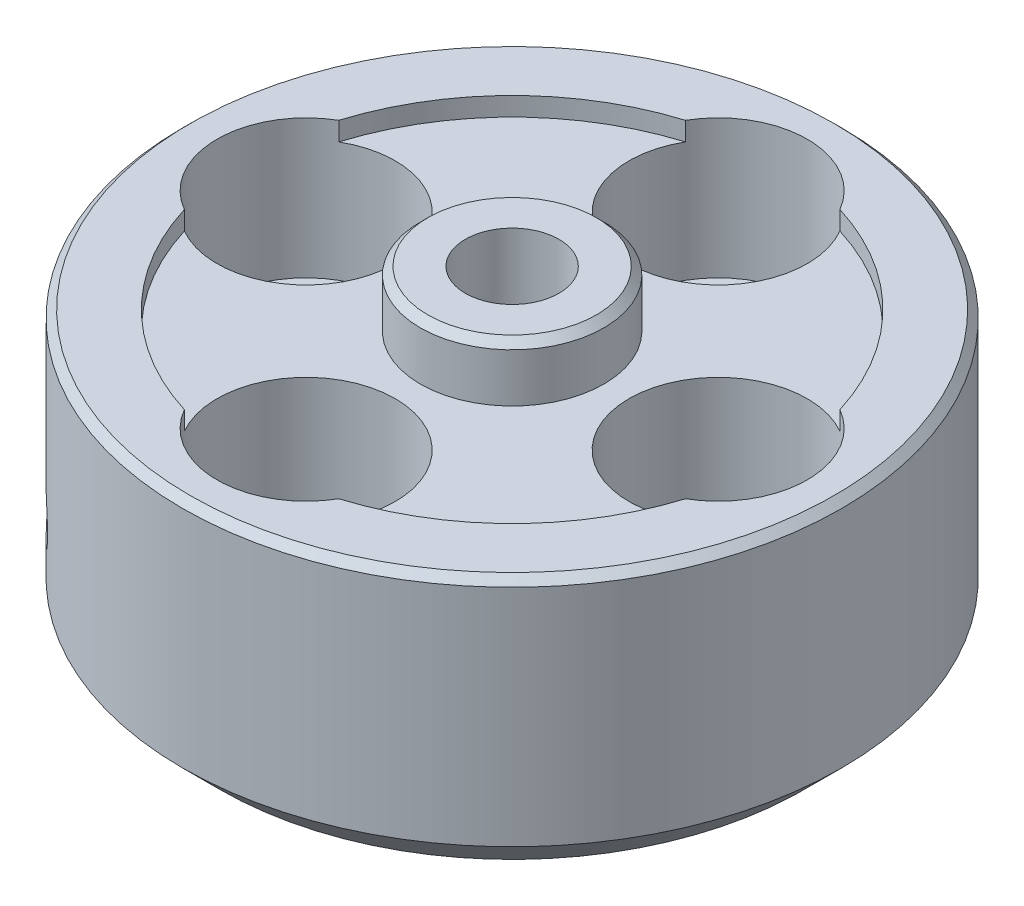
ISO-10303-21;
HEADER;
FILE_DESCRIPTION(('STEP AP214'),'2;1');
FILE_NAME('part.step','',(''),(''),'','','');
FILE_SCHEMA(('AUTOMOTIVE_DESIGN { 1 0 10303 214 1 1 1 1 }'));
ENDSEC;
DATA;
#1=APPLICATION_CONTEXT('core data for automotive mechanical design processes');
#2=APPLICATION_PROTOCOL_DEFINITION('international standard','automotive_design',2000,#1);
#3=PRODUCT_CONTEXT('',#1,'mechanical');
#4=PRODUCT('Part','Part','',(#3));
#5=PRODUCT_RELATED_PRODUCT_CATEGORY('part','',(#4));
#6=PRODUCT_DEFINITION_FORMATION('','',#4);
#7=PRODUCT_DEFINITION_CONTEXT('part definition',#1,'design');
#8=PRODUCT_DEFINITION('design','',#6,#7);
#9=PRODUCT_DEFINITION_SHAPE('','',#8);
#10=(LENGTH_UNIT() NAMED_UNIT(*) SI_UNIT(.MILLI.,.METRE.));
#11=(NAMED_UNIT(*) PLANE_ANGLE_UNIT() SI_UNIT($,.RADIAN.));
#12=(NAMED_UNIT(*) SI_UNIT($,.STERADIAN.) SOLID_ANGLE_UNIT());
#13=UNCERTAINTY_MEASURE_WITH_UNIT(LENGTH_MEASURE(1.E-05),#10,'distance_accuracy_value','');
#14=(GEOMETRIC_REPRESENTATION_CONTEXT(3) GLOBAL_UNCERTAINTY_ASSIGNED_CONTEXT((#13)) GLOBAL_UNIT_ASSIGNED_CONTEXT((#10,
#11,#12)) REPRESENTATION_CONTEXT('',''));
#15=CARTESIAN_POINT('',(0.,0.,0.));
#16=DIRECTION('',(0.,0.,1.));
#17=DIRECTION('',(1.,0.,0.));
#18=AXIS2_PLACEMENT_3D('',#15,#16,#17);
#19=CARTESIAN_POINT('',(0.,8.509,0.));
#20=DIRECTION('',(0.,1.,0.));
#21=DIRECTION('',(0.,0.,1.));
#22=AXIS2_PLACEMENT_3D('',#19,#20,#21);
#23=CYLINDRICAL_SURFACE('',#22,8.89);
#24=CARTESIAN_POINT('',(0.,8.509,0.));
#25=DIRECTION('',(0.,1.,0.));
#26=DIRECTION('',(0.,0.,1.));
#27=AXIS2_PLACEMENT_3D('',#24,#25,#26);
#28=CIRCLE('',#27,8.89);
#29=CARTESIAN_POINT('',(8.49579200000001,8.509,-2.6179416136988));
#30=VERTEX_POINT('',#29);
#31=CARTESIAN_POINT('',(2.61794161369883,8.509,-8.495792));
#32=VERTEX_POINT('',#31);
#33=EDGE_CURVE('E158',#30,#32,#28,.T.);
#34=ORIENTED_EDGE('',*,*,#33,.F.);
#35=DIRECTION('',(0.,1.,0.));
#36=VECTOR('',#35,1.);
#37=CARTESIAN_POINT('',(8.495792,6.7945,-2.6179416136988));
#38=LINE('',#37,#36);
#39=CARTESIAN_POINT('',(8.49579200000001,9.144,-2.6179416136988));
#40=VERTEX_POINT('',#39);
#41=EDGE_CURVE('E76',#30,#40,#38,.T.);
#42=ORIENTED_EDGE('',*,*,#41,.T.);
#43=CARTESIAN_POINT('',(0.,9.144,0.));
#44=DIRECTION('',(0.,1.,0.));
#45=DIRECTION('',(0.,0.,1.));
#46=AXIS2_PLACEMENT_3D('',#43,#44,#45);
#47=CIRCLE('',#46,8.89);
#48=CARTESIAN_POINT('',(2.61794161369883,9.144,-8.495792));
#49=VERTEX_POINT('',#48);
#50=EDGE_CURVE('E160',#40,#49,#47,.T.);
#51=ORIENTED_EDGE('',*,*,#50,.T.);
#52=DIRECTION('',(0.,1.,0.));
#53=VECTOR('',#52,1.);
#54=CARTESIAN_POINT('',(2.61794161369883,6.7945,-8.49579199999999));
#55=LINE('',#54,#53);
#56=EDGE_CURVE('E224',#49,#32,#55,.F.);
#57=ORIENTED_EDGE('',*,*,#56,.T.);
#58=EDGE_LOOP('',(#34,#42,#51,#57));
#59=FACE_BOUND('',#58,.T.);
#60=ADVANCED_FACE('F53',(#59),#23,.F.);
#61=CARTESIAN_POINT('',(2.61794161369883,9.144,8.495792));
#62=VERTEX_POINT('',#61);
#63=CARTESIAN_POINT('',(8.49579199999999,9.144,2.61794161369885));
#64=VERTEX_POINT('',#63);
#65=EDGE_CURVE('E166',#62,#64,#47,.T.);
#66=ORIENTED_EDGE('',*,*,#65,.T.);
#67=DIRECTION('',(0.,1.,0.));
#68=VECTOR('',#67,1.);
#69=CARTESIAN_POINT('',(8.49579199999999,6.7945,2.61794161369886));
#70=LINE('',#69,#68);
#71=CARTESIAN_POINT('',(8.49579199999999,8.509,2.61794161369886));
#72=VERTEX_POINT('',#71);
#73=EDGE_CURVE('E209',#64,#72,#70,.F.);
#74=ORIENTED_EDGE('',*,*,#73,.T.);
#75=CARTESIAN_POINT('',(2.61794161369883,8.509,8.495792));
#76=VERTEX_POINT('',#75);
#77=EDGE_CURVE('E163',#76,#72,#28,.T.);
#78=ORIENTED_EDGE('',*,*,#77,.F.);
#79=DIRECTION('',(0.,1.,0.));
#80=VECTOR('',#79,1.);
#81=CARTESIAN_POINT('',(2.61794161369883,6.7945,8.49579199999999));
#82=LINE('',#81,#80);
#83=EDGE_CURVE('E84',#76,#62,#82,.T.);
#84=ORIENTED_EDGE('',*,*,#83,.T.);
#85=EDGE_LOOP('',(#66,#74,#78,#84));
#86=FACE_BOUND('',#85,.T.);
#87=ADVANCED_FACE('F207',(#86),#23,.F.);
#88=CARTESIAN_POINT('',(-8.49579200000002,9.144,2.61794161369874));
#89=VERTEX_POINT('',#88);
#90=CARTESIAN_POINT('',(-2.61794161369883,9.144,8.495792));
#91=VERTEX_POINT('',#90);
#92=EDGE_CURVE('E149',#89,#91,#47,.T.);
#93=ORIENTED_EDGE('',*,*,#92,.T.);
#94=DIRECTION('',(0.,1.,0.));
#95=VECTOR('',#94,1.);
#96=CARTESIAN_POINT('',(-2.61794161369883,6.7945,8.49579199999999));
#97=LINE('',#96,#95);
#98=CARTESIAN_POINT('',(-2.61794161369883,8.509,8.495792));
#99=VERTEX_POINT('',#98);
#100=EDGE_CURVE('E216',#91,#99,#97,.F.);
#101=ORIENTED_EDGE('',*,*,#100,.T.);
#102=CARTESIAN_POINT('',(-8.49579200000002,8.509,2.61794161369874));
#103=VERTEX_POINT('',#102);
#104=EDGE_CURVE('E189',#103,#99,#28,.T.);
#105=ORIENTED_EDGE('',*,*,#104,.F.);
#106=DIRECTION('',(0.,1.,0.));
#107=VECTOR('',#106,1.);
#108=CARTESIAN_POINT('',(-8.49579200000002,6.7945,2.61794161369874));
#109=LINE('',#108,#107);
#110=EDGE_CURVE('E137',#103,#89,#109,.T.);
#111=ORIENTED_EDGE('',*,*,#110,.T.);
#112=EDGE_LOOP('',(#93,#101,#105,#111));
#113=FACE_BOUND('',#112,.T.);
#114=ADVANCED_FACE('F246',(#113),#23,.F.);
#115=CARTESIAN_POINT('',(0.,9.144,0.));
#116=DIRECTION('',(0.,-1.,0.));
#117=DIRECTION('',(0.,0.,-1.));
#118=AXIS2_PLACEMENT_3D('',#115,#116,#117);
#119=CYLINDRICAL_SURFACE('',#118,11.176);
#120=CARTESIAN_POINT('',(-7.24896593334474,3.17500000000002,8.50620179029439));
#121=CARTESIAN_POINT('',(-7.24896780804713,3.12514930597726,8.5062005804849));
#122=CARTESIAN_POINT('',(-7.25217999708526,3.07526447765731,8.50346601522818));
#123=CARTESIAN_POINT('',(-7.26492727832901,2.97687449868191,8.49257765298987));
#124=CARTESIAN_POINT('',(-7.27446957454482,2.92837098570709,8.48441768157353));
#125=CARTESIAN_POINT('',(-7.29954104643281,2.83418293075079,8.4628569790131));
#126=CARTESIAN_POINT('',(-7.31506687546892,2.78849682950911,8.44945917736761));
#127=CARTESIAN_POINT('',(-7.3515692618953,2.7012171140266,8.41771866647179));
#128=CARTESIAN_POINT('',(-7.37254463719479,2.65962261494825,8.39937702958341));
#129=CARTESIAN_POINT('',(-7.41929322462298,2.58159793637769,8.35811194287085));
#130=CARTESIAN_POINT('',(-7.44507634053909,2.54517869566048,8.33517902784882));
#131=CARTESIAN_POINT('',(-7.50056596666619,2.47863226002729,8.28528065373223));
#132=CARTESIAN_POINT('',(-7.53027264659895,2.44850533744399,8.2583150201875));
#133=CARTESIAN_POINT('',(-7.59269842993955,2.39536275785312,8.20095743682159));
#134=CARTESIAN_POINT('',(-7.62542144276832,2.37235650291702,8.17056102864898));
#135=CARTESIAN_POINT('',(-7.69282138546689,2.33416846732365,8.10713354570003));
#136=CARTESIAN_POINT('',(-7.72749828382991,2.3189865605373,8.07410251340396));
#137=CARTESIAN_POINT('',(-7.79767412549962,2.29690949597868,8.00634914930667));
#138=CARTESIAN_POINT('',(-7.83317115653157,2.28999672245756,7.97163057737534));
#139=CARTESIAN_POINT('',(-7.90401401165878,2.28459970733818,7.90139392906694));
#140=CARTESIAN_POINT('',(-7.93935983833104,2.28611532151555,7.86587586638089));
#141=CARTESIAN_POINT('',(-8.00882052752845,2.29751762887042,7.79514092777523));
#142=CARTESIAN_POINT('',(-8.04293799373868,2.30738537815985,7.7599235522918));
#143=CARTESIAN_POINT('',(-8.10910631798705,2.33518240216042,7.69075179063));
#144=CARTESIAN_POINT('',(-8.14115715784661,2.3531117477724,7.65679741556241));
#145=CARTESIAN_POINT('',(-8.2024033912797,2.39654419836266,7.59115105578475));
#146=CARTESIAN_POINT('',(-8.23159552925757,2.42205580795842,7.55946166135778));
#147=CARTESIAN_POINT('',(-8.28636871301417,2.47992242901212,7.49938163061777));
#148=CARTESIAN_POINT('',(-8.31194969214277,2.51227756675158,7.47099105519179));
#149=CARTESIAN_POINT('',(-8.35896615364474,2.5830196147484,7.41834972566505));
#150=CARTESIAN_POINT('',(-8.38038995853565,2.62142298226812,7.39411065487935));
#151=CARTESIAN_POINT('',(-8.41851633927658,2.70311394491662,7.35067320924383));
#152=CARTESIAN_POINT('',(-8.43521891171765,2.74640154357199,7.33147483803365));
#153=CARTESIAN_POINT('',(-8.46353379240768,2.83664356852837,7.298769898311));
#154=CARTESIAN_POINT('',(-8.47514555021277,2.88359839070124,7.28526394529687));
#155=CARTESIAN_POINT('',(-8.49302161197882,2.97983660126441,7.26441670960931));
#156=CARTESIAN_POINT('',(-8.49928601825131,3.02911994508379,7.25707530898881));
#157=CARTESIAN_POINT('',(-8.50632174112468,3.12847177385202,7.24882723898001));
#158=CARTESIAN_POINT('',(-8.50710805057354,3.17853773967687,7.24790300664918));
#159=CARTESIAN_POINT('',(-8.50321033438375,3.27816054404755,7.25247534864569));
#160=CARTESIAN_POINT('',(-8.49852635517117,3.32771738691067,7.25797186848043));
#161=CARTESIAN_POINT('',(-8.48379916585896,3.42484932248812,7.27518071111218));
#162=CARTESIAN_POINT('',(-8.47376297131458,3.47242692174238,7.28688489694039));
#163=CARTESIAN_POINT('',(-8.44855317258453,3.56432740527211,7.31609837118184));
#164=CARTESIAN_POINT('',(-8.43337949317989,3.60865024188236,7.33360774458993));
#165=CARTESIAN_POINT('',(-8.39818885413517,3.69288846259005,7.37388051688057));
#166=CARTESIAN_POINT('',(-8.37816147447179,3.73279409156066,7.39665521455843));
#167=CARTESIAN_POINT('',(-8.33373036383271,3.80696659519307,7.44667915432871));
#168=CARTESIAN_POINT('',(-8.30932656417486,3.84123338134448,7.47392846664375));
#169=CARTESIAN_POINT('',(-8.25664895219383,3.9032339023002,7.53208230189797));
#170=CARTESIAN_POINT('',(-8.22836651544604,3.930952692334,7.56299494910339));
#171=CARTESIAN_POINT('',(-8.16866181872159,3.97896790226842,7.62744170720748));
#172=CARTESIAN_POINT('',(-8.13723958771967,3.99926439065569,7.66097579391429));
#173=CARTESIAN_POINT('',(-8.07209517083537,4.03183312109877,7.72958529697618));
#174=CARTESIAN_POINT('',(-8.03837569655573,4.04411464858617,7.7646588793283));
#175=CARTESIAN_POINT('',(-7.96950741680303,4.06033518576027,7.835327730576));
#176=CARTESIAN_POINT('',(-7.93435863575316,4.06427433793579,7.87092299055079));
#177=CARTESIAN_POINT('',(-7.86371493385172,4.063696708215,7.941501728871));
#178=CARTESIAN_POINT('',(-7.82822123619204,4.05920323619941,7.97648662465759));
#179=CARTESIAN_POINT('',(-7.75782183111716,4.04193646455699,8.04497290636179));
#180=CARTESIAN_POINT('',(-7.72291612455662,4.02916315289634,8.0784742901232));
#181=CARTESIAN_POINT('',(-7.65474109312152,3.99570509420087,8.14310277548355));
#182=CARTESIAN_POINT('',(-7.62147169374717,3.97502070772814,8.17422998521239));
#183=CARTESIAN_POINT('',(-7.55759379763578,3.92633039680918,8.23332543323576));
#184=CARTESIAN_POINT('',(-7.52698525340785,3.89832460307108,8.26129372791321));
#185=CARTESIAN_POINT('',(-7.4693200784616,3.83569906949992,8.31346812312555));
#186=CARTESIAN_POINT('',(-7.44227300228167,3.80106212645584,8.33766413427809));
#187=CARTESIAN_POINT('',(-7.39270126826641,3.72618760051195,8.38164932034557));
#188=CARTESIAN_POINT('',(-7.37017770949057,3.68594866053047,8.4014374244175));
#189=CARTESIAN_POINT('',(-7.3303798644817,3.60094090524256,8.43618446896604));
#190=CARTESIAN_POINT('',(-7.3131147940943,3.55616431831194,8.4511349339909));
#191=CARTESIAN_POINT('',(-7.28449555449908,3.4634397914791,8.47581624226662));
#192=CARTESIAN_POINT('',(-7.27313456386681,3.41549558390947,8.48555310957307));
#193=CARTESIAN_POINT('',(-7.2596224488605,3.33522194611833,8.49711146281521));
#194=CARTESIAN_POINT('',(-7.25563249215651,3.30340935807369,8.50051678348884));
#195=CARTESIAN_POINT('',(-7.25030363197019,3.23940259577352,8.5050623353287));
#196=CARTESIAN_POINT('',(-7.2489647221037,3.2072084224371,8.5062025719496));
#197=CARTESIAN_POINT('',(-7.24896593334474,3.17500000000002,8.50620179029439));
#198=B_SPLINE_CURVE_WITH_KNOTS('',3,(#120,#121,#122,#123,#124,#125,#126,#127,#128,#129,#130,
#131,#132,#133,#134,#135,#136,#137,#138,#139,#140,#141,#142,#143,#144,#145,#146,#147,#148,#149,
#150,#151,#152,#153,#154,#155,#156,#157,#158,#159,#160,#161,#162,#163,#164,#165,#166,#167,#168,
#169,#170,#171,#172,#173,#174,#175,#176,#177,#178,#179,#180,#181,#182,#183,#184,#185,#186,#187,
#188,#189,#190,#191,#192,#193,#194,#195,#196,#197),.UNSPECIFIED.,.T.,.F.,(4,2,2,2,2,2,2,2,2,2,2,
2,2,2,2,2,2,2,2,2,2,2,2,2,2,2,2,2,2,2,2,2,2,2,2,2,2,2,4),(0.,0.149434486860927,
0.299039330815013,0.448560620776888,0.598049504300691,0.74784980183038,0.897656581401479,
1.04766032899126,1.19766165843346,1.3473428674478,1.49702151516441,1.64636157633573,
1.79570295096215,1.94521247003284,2.09472474819732,2.24465111176717,2.39457758359047,
2.54452026220482,2.69446007188329,2.84398935376547,2.99351736660901,3.14284986173971,
3.29218454337238,3.44184270475756,3.59150321503619,3.74150207115184,3.89149954317171,
4.04132293131245,4.19114376043016,4.34055105724456,4.48995857120646,4.63935927645163,
4.78875731464786,4.93854832157536,5.08837567866554,5.23846412679325,5.38837877881978,
5.48492830063627,5.58147758994583),.UNSPECIFIED.);
#199=CARTESIAN_POINT('',(-7.24896593334474,3.17500000000002,8.50620179029439));
#200=VERTEX_POINT('',#199);
#201=EDGE_CURVE('E332',#200,#200,#198,.T.);
#202=ORIENTED_EDGE('',*,*,#201,.T.);
#203=EDGE_LOOP('',(#202));
#204=FACE_BOUND('',#203,.T.);
#205=CARTESIAN_POINT('',(0.,1.27,0.));
#206=DIRECTION('',(0.,1.,0.));
#207=DIRECTION('',(0.,0.,1.));
#208=AXIS2_PLACEMENT_3D('',#205,#206,#207);
#209=CIRCLE('',#208,11.176);
#210=CARTESIAN_POINT('',(0.,1.27,11.176));
#211=VERTEX_POINT('',#210);
#212=EDGE_CURVE('E363',#211,#211,#209,.T.);
#213=ORIENTED_EDGE('',*,*,#212,.T.);
#214=EDGE_LOOP('',(#213));
#215=FACE_BOUND('',#214,.T.);
#216=CARTESIAN_POINT('',(0.,8.89000000000001,0.));
#217=DIRECTION('',(0.,1.,0.));
#218=DIRECTION('',(0.,0.,1.));
#219=AXIS2_PLACEMENT_3D('',#216,#217,#218);
#220=CIRCLE('',#219,11.176);
#221=CARTESIAN_POINT('',(0.,8.89000000000001,11.176));
#222=VERTEX_POINT('',#221);
#223=EDGE_CURVE('E366',#222,#222,#220,.F.);
#224=ORIENTED_EDGE('',*,*,#223,.T.);
#225=EDGE_LOOP('',(#224));
#226=FACE_BOUND('',#225,.T.);
#227=ADVANCED_FACE('F248',(#204,#215,#226),#119,.T.);
#228=CARTESIAN_POINT('',(0.,9.144,0.));
#229=DIRECTION('',(0.,1.,0.));
#230=DIRECTION('',(0.,0.,1.));
#231=AXIS2_PLACEMENT_3D('',#228,#229,#230);
#232=PLANE('',#231);
#233=CARTESIAN_POINT('',(0.,9.144,0.));
#234=DIRECTION('',(0.,1.,0.));
#235=DIRECTION('',(0.,0.,1.));
#236=AXIS2_PLACEMENT_3D('',#233,#234,#235);
#237=CIRCLE('',#236,10.922);
#238=CARTESIAN_POINT('',(0.,9.144,10.922));
#239=VERTEX_POINT('',#238);
#240=EDGE_CURVE('E372',#239,#239,#237,.T.);
#241=ORIENTED_EDGE('',*,*,#240,.T.);
#242=EDGE_LOOP('',(#241));
#243=FACE_BOUND('',#242,.T.);
#244=CARTESIAN_POINT('',(6.985,9.144,0.));
#245=DIRECTION('',(0.,1.,0.));
#246=DIRECTION('',(-1.,0.,0.));
#247=AXIS2_PLACEMENT_3D('',#244,#245,#246);
#248=CIRCLE('',#247,3.0226);
#249=EDGE_CURVE('E583',#64,#40,#248,.T.);
#250=ORIENTED_EDGE('',*,*,#249,.F.);
#251=ORIENTED_EDGE('',*,*,#65,.F.);
#252=CARTESIAN_POINT('',(0.,9.144,6.985));
#253=DIRECTION('',(0.,1.,0.));
#254=DIRECTION('',(0.,0.,-1.));
#255=AXIS2_PLACEMENT_3D('',#252,#253,#254);
#256=CIRCLE('',#255,3.0226);
#257=EDGE_CURVE('E576',#91,#62,#256,.T.);
#258=ORIENTED_EDGE('',*,*,#257,.F.);
#259=ORIENTED_EDGE('',*,*,#92,.F.);
#260=CARTESIAN_POINT('',(-6.985,9.144,0.));
#261=DIRECTION('',(0.,1.,0.));
#262=DIRECTION('',(1.,0.,0.));
#263=AXIS2_PLACEMENT_3D('',#260,#261,#262);
#264=CIRCLE('',#263,3.0226);
#265=CARTESIAN_POINT('',(-8.49579199999997,9.144,-2.61794161369891));
#266=VERTEX_POINT('',#265);
#267=EDGE_CURVE('E128',#266,#89,#264,.T.);
#268=ORIENTED_EDGE('',*,*,#267,.F.);
#269=CARTESIAN_POINT('',(-2.61794161369883,9.144,-8.495792));
#270=VERTEX_POINT('',#269);
#271=EDGE_CURVE('E146',#270,#266,#47,.T.);
#272=ORIENTED_EDGE('',*,*,#271,.F.);
#273=CARTESIAN_POINT('',(0.,9.144,-6.985));
#274=DIRECTION('',(0.,1.,0.));
#275=DIRECTION('',(0.,0.,1.));
#276=AXIS2_PLACEMENT_3D('',#273,#274,#275);
#277=CIRCLE('',#276,3.0226);
#278=EDGE_CURVE('E214',#49,#270,#277,.T.);
#279=ORIENTED_EDGE('',*,*,#278,.F.);
#280=ORIENTED_EDGE('',*,*,#50,.F.);
#281=EDGE_LOOP('',(#250,#251,#258,#259,#268,#272,#279,#280));
#282=FACE_BOUND('',#281,.T.);
#283=ADVANCED_FACE('F144',(#243,#282),#232,.T.);
#284=CARTESIAN_POINT('',(0.,0.,0.));
#285=DIRECTION('',(0.,1.,0.));
#286=DIRECTION('',(0.,0.,1.));
#287=AXIS2_PLACEMENT_3D('',#284,#285,#286);
#288=PLANE('',#287);
#289=CARTESIAN_POINT('',(6.985,0.,0.));
#290=DIRECTION('',(0.,1.,0.));
#291=DIRECTION('',(0.,0.,1.));
#292=AXIS2_PLACEMENT_3D('',#289,#290,#291);
#293=CIRCLE('',#292,0.9921875);
#294=CARTESIAN_POINT('',(6.985,0.,0.992187500000024));
#295=VERTEX_POINT('',#294);
#296=EDGE_CURVE('E597',#295,#295,#293,.F.);
#297=ORIENTED_EDGE('',*,*,#296,.F.);
#298=EDGE_LOOP('',(#297));
#299=FACE_BOUND('',#298,.T.);
#300=CARTESIAN_POINT('',(0.,0.,6.985));
#301=DIRECTION('',(0.,1.,0.));
#302=DIRECTION('',(0.,0.,1.));
#303=AXIS2_PLACEMENT_3D('',#300,#301,#302);
#304=CIRCLE('',#303,0.9921875);
#305=CARTESIAN_POINT('',(0.,0.,7.9771875));
#306=VERTEX_POINT('',#305);
#307=EDGE_CURVE('E607',#306,#306,#304,.F.);
#308=ORIENTED_EDGE('',*,*,#307,.F.);
#309=EDGE_LOOP('',(#308));
#310=FACE_BOUND('',#309,.T.);
#311=CARTESIAN_POINT('',(-6.985,0.,0.));
#312=DIRECTION('',(0.,1.,0.));
#313=DIRECTION('',(0.,0.,1.));
#314=AXIS2_PLACEMENT_3D('',#311,#312,#313);
#315=CIRCLE('',#314,0.9921875);
#316=CARTESIAN_POINT('',(-6.985,0.,0.992187499999927));
#317=VERTEX_POINT('',#316);
#318=EDGE_CURVE('E598',#317,#317,#315,.F.);
#319=ORIENTED_EDGE('',*,*,#318,.F.);
#320=EDGE_LOOP('',(#319));
#321=FACE_BOUND('',#320,.T.);
#322=CARTESIAN_POINT('',(0.,0.,-6.985));
#323=DIRECTION('',(0.,1.,0.));
#324=DIRECTION('',(0.,0.,1.));
#325=AXIS2_PLACEMENT_3D('',#322,#323,#324);
#326=CIRCLE('',#325,0.9921875);
#327=CARTESIAN_POINT('',(0.,0.,-5.9928125));
#328=VERTEX_POINT('',#327);
#329=EDGE_CURVE('E589',#328,#328,#326,.F.);
#330=ORIENTED_EDGE('',*,*,#329,.F.);
#331=EDGE_LOOP('',(#330));
#332=FACE_BOUND('',#331,.T.);
#333=CARTESIAN_POINT('',(0.,0.,0.));
#334=DIRECTION('',(0.,1.,0.));
#335=DIRECTION('',(0.,0.,1.));
#336=AXIS2_PLACEMENT_3D('',#333,#334,#335);
#337=CIRCLE('',#336,9.906);
#338=CARTESIAN_POINT('',(0.,0.,9.906));
#339=VERTEX_POINT('',#338);
#340=EDGE_CURVE('E360',#339,#339,#337,.F.);
#341=ORIENTED_EDGE('',*,*,#340,.T.);
#342=EDGE_LOOP('',(#341));
#343=FACE_BOUND('',#342,.T.);
#344=CARTESIAN_POINT('',(0.,0.,0.));
#345=DIRECTION('',(0.,-1.,0.));
#346=DIRECTION('',(0.,0.,-1.));
#347=AXIS2_PLACEMENT_3D('',#344,#345,#346);
#348=CIRCLE('',#347,3.0226);
#349=CARTESIAN_POINT('',(0.,0.,-3.0226));
#350=VERTEX_POINT('',#349);
#351=EDGE_CURVE('E184',#350,#350,#348,.T.);
#352=ORIENTED_EDGE('',*,*,#351,.F.);
#353=EDGE_LOOP('',(#352));
#354=FACE_BOUND('',#353,.T.);
#355=ADVANCED_FACE('F236',(#299,#310,#321,#332,#343,#354),#288,.F.);
#356=ORIENTED_EDGE('',*,*,#271,.T.);
#357=DIRECTION('',(0.,1.,0.));
#358=VECTOR('',#357,1.);
#359=CARTESIAN_POINT('',(-8.49579199999997,6.7945,-2.61794161369892));
#360=LINE('',#359,#358);
#361=CARTESIAN_POINT('',(-8.49579199999997,8.509,-2.61794161369892));
#362=VERTEX_POINT('',#361);
#363=EDGE_CURVE('E125',#266,#362,#360,.F.);
#364=ORIENTED_EDGE('',*,*,#363,.T.);
#365=CARTESIAN_POINT('',(-2.61794161369883,8.509,-8.495792));
#366=VERTEX_POINT('',#365);
#367=EDGE_CURVE('E165',#366,#362,#28,.T.);
#368=ORIENTED_EDGE('',*,*,#367,.F.);
#369=DIRECTION('',(0.,1.,0.));
#370=VECTOR('',#369,1.);
#371=CARTESIAN_POINT('',(-2.61794161369883,6.7945,-8.49579199999999));
#372=LINE('',#371,#370);
#373=EDGE_CURVE('E156',#366,#270,#372,.T.);
#374=ORIENTED_EDGE('',*,*,#373,.T.);
#375=EDGE_LOOP('',(#356,#364,#368,#374));
#376=FACE_BOUND('',#375,.T.);
#377=ADVANCED_FACE('F155',(#376),#23,.F.);
#378=CARTESIAN_POINT('',(0.,8.509,0.));
#379=DIRECTION('',(0.,1.,0.));
#380=DIRECTION('',(0.,0.,1.));
#381=AXIS2_PLACEMENT_3D('',#378,#379,#380);
#382=PLANE('',#381);
#383=CARTESIAN_POINT('',(6.985,8.509,0.));
#384=DIRECTION('',(0.,1.,0.));
#385=DIRECTION('',(0.,0.,1.));
#386=AXIS2_PLACEMENT_3D('',#383,#384,#385);
#387=CIRCLE('',#386,3.0226);
#388=EDGE_CURVE('E202',#30,#72,#387,.T.);
#389=ORIENTED_EDGE('',*,*,#388,.F.);
#390=ORIENTED_EDGE('',*,*,#33,.T.);
#391=CARTESIAN_POINT('',(0.,8.509,-6.985));
#392=DIRECTION('',(0.,1.,0.));
#393=DIRECTION('',(0.,0.,1.));
#394=AXIS2_PLACEMENT_3D('',#391,#392,#393);
#395=CIRCLE('',#394,3.0226);
#396=EDGE_CURVE('E188',#366,#32,#395,.T.);
#397=ORIENTED_EDGE('',*,*,#396,.F.);
#398=ORIENTED_EDGE('',*,*,#367,.T.);
#399=CARTESIAN_POINT('',(-6.985,8.509,0.));
#400=DIRECTION('',(0.,1.,0.));
#401=DIRECTION('',(0.,0.,1.));
#402=AXIS2_PLACEMENT_3D('',#399,#400,#401);
#403=CIRCLE('',#402,3.0226);
#404=EDGE_CURVE('E131',#103,#362,#403,.T.);
#405=ORIENTED_EDGE('',*,*,#404,.F.);
#406=ORIENTED_EDGE('',*,*,#104,.T.);
#407=CARTESIAN_POINT('',(0.,8.509,6.985));
#408=DIRECTION('',(0.,1.,0.));
#409=DIRECTION('',(0.,0.,1.));
#410=AXIS2_PLACEMENT_3D('',#407,#408,#409);
#411=CIRCLE('',#410,3.0226);
#412=EDGE_CURVE('E204',#76,#99,#411,.T.);
#413=ORIENTED_EDGE('',*,*,#412,.F.);
#414=ORIENTED_EDGE('',*,*,#77,.T.);
#415=EDGE_LOOP('',(#389,#390,#397,#398,#405,#406,#413,#414));
#416=FACE_BOUND('',#415,.T.);
#417=CARTESIAN_POINT('',(0.,8.509,0.));
#418=DIRECTION('',(0.,1.,0.));
#419=DIRECTION('',(0.,0.,1.));
#420=AXIS2_PLACEMENT_3D('',#417,#418,#419);
#421=CIRCLE('',#420,3.1115);
#422=CARTESIAN_POINT('',(0.,8.509,3.1115));
#423=VERTEX_POINT('',#422);
#424=EDGE_CURVE('E169',#423,#423,#421,.T.);
#425=ORIENTED_EDGE('',*,*,#424,.F.);
#426=EDGE_LOOP('',(#425));
#427=FACE_BOUND('',#426,.T.);
#428=ADVANCED_FACE('F200',(#416,#427),#382,.T.);
#429=CARTESIAN_POINT('',(0.,8.509,0.));
#430=DIRECTION('',(0.,1.,0.));
#431=DIRECTION('',(0.,0.,1.));
#432=AXIS2_PLACEMENT_3D('',#429,#430,#431);
#433=CYLINDRICAL_SURFACE('',#432,3.1115);
#434=CARTESIAN_POINT('',(0.,10.16,0.));
#435=DIRECTION('',(0.,1.,0.));
#436=DIRECTION('',(0.,0.,1.));
#437=AXIS2_PLACEMENT_3D('',#434,#435,#436);
#438=CIRCLE('',#437,3.1115);
#439=CARTESIAN_POINT('',(0.,10.16,3.1115));
#440=VERTEX_POINT('',#439);
#441=EDGE_CURVE('E11',#440,#440,#438,.F.);
#442=ORIENTED_EDGE('',*,*,#441,.T.);
#443=EDGE_LOOP('',(#442));
#444=FACE_BOUND('',#443,.T.);
#445=ORIENTED_EDGE('',*,*,#424,.T.);
#446=EDGE_LOOP('',(#445));
#447=FACE_BOUND('',#446,.T.);
#448=ADVANCED_FACE('F262',(#444,#447),#433,.T.);
#449=CARTESIAN_POINT('',(0.,5.334,0.));
#450=DIRECTION('',(0.,-1.,0.));
#451=DIRECTION('',(0.,0.,-1.));
#452=AXIS2_PLACEMENT_3D('',#449,#450,#451);
#453=CYLINDRICAL_SURFACE('',#452,3.0226);
#454=CARTESIAN_POINT('',(-1.41414854863409,3.17500000000002,2.67138440558376));
#455=CARTESIAN_POINT('',(-1.41414947429001,3.22376205791728,2.67138430652724));
#456=CARTESIAN_POINT('',(-1.41787760302213,3.2725313284163,2.66942042620292));
#457=CARTESIAN_POINT('',(-1.43257830865558,3.36864724886078,2.66155923556818));
#458=CARTESIAN_POINT('',(-1.44355352342577,3.415993374232,2.65566049299818));
#459=CARTESIAN_POINT('',(-1.47212716233388,3.50785789938019,2.63992721627506));
#460=CARTESIAN_POINT('',(-1.48971488819843,3.5523807316639,2.63009903787187));
#461=CARTESIAN_POINT('',(-1.53065656898946,3.6375524013155,2.60648375059084));
#462=CARTESIAN_POINT('',(-1.55401131358864,3.67820070709061,2.5926960995038));
#463=CARTESIAN_POINT('',(-1.60618871415972,3.7557058562382,2.56070854095709));
#464=CARTESIAN_POINT('',(-1.63514426547989,3.79242742049518,2.54239755755668));
#465=CARTESIAN_POINT('',(-1.69689776873025,3.8598334849753,2.50160273208887));
#466=CARTESIAN_POINT('',(-1.72969619507381,3.89051723855878,2.4791183746065));
#467=CARTESIAN_POINT('',(-1.79857059884877,3.9455597947891,2.42962658187865));
#468=CARTESIAN_POINT('',(-1.83469862269575,3.96978129909177,2.40253838757179));
#469=CARTESIAN_POINT('',(-1.90828308687318,4.01031147017795,2.34451659040526));
#470=CARTESIAN_POINT('',(-1.94573925065502,4.02662177398895,2.31358378475857));
#471=CARTESIAN_POINT('',(-2.01956430031719,4.05042069395524,2.24939908736793));
#472=CARTESIAN_POINT('',(-2.05593469788281,4.05814007750253,2.21623462011589));
#473=CARTESIAN_POINT('',(-2.12740487641663,4.06526704764699,2.14772150327773));
#474=CARTESIAN_POINT('',(-2.16250491280309,4.06467631448508,2.11237329666573));
#475=CARTESIAN_POINT('',(-2.22933701124818,4.05535612548717,2.04168131213674));
#476=CARTESIAN_POINT('',(-2.26113929562206,4.04687645930207,2.00637054796644));
#477=CARTESIAN_POINT('',(-2.3218161226903,4.02242631259548,1.93583222132205));
#478=CARTESIAN_POINT('',(-2.3506904827112,4.00645536504154,1.90060466417303));
#479=CARTESIAN_POINT('',(-2.40531180628908,3.96730284748411,1.83100163337078));
#480=CARTESIAN_POINT('',(-2.43101952482224,3.9440414411024,1.79664038180879));
#481=CARTESIAN_POINT('',(-2.47862837246576,3.89103109050119,1.73036976363695));
#482=CARTESIAN_POINT('',(-2.50052862470892,3.8612806553926,1.69846096277299));
#483=CARTESIAN_POINT('',(-2.54113074778172,3.79483546453086,1.63712230370637));
#484=CARTESIAN_POINT('',(-2.55968376408399,3.7579239733455,1.60782838496544));
#485=CARTESIAN_POINT('',(-2.59252139748213,3.67887610923367,1.55432673676113));
#486=CARTESIAN_POINT('',(-2.60680562395754,3.63673925865363,1.53011947281802));
#487=CARTESIAN_POINT('',(-2.63123195992614,3.54792406642324,1.48772833733444));
#488=CARTESIAN_POINT('',(-2.6413360668106,3.50120863771719,1.46960000071327));
#489=CARTESIAN_POINT('',(-2.65723958101196,3.40487388515181,1.44064726562244));
#490=CARTESIAN_POINT('',(-2.6630403287834,3.35525547074425,1.42982059285105));
#491=CARTESIAN_POINT('',(-2.67022528963197,3.25643382519339,1.41635595318907));
#492=CARTESIAN_POINT('',(-2.6717606985722,3.20727973083401,1.41343774603881));
#493=CARTESIAN_POINT('',(-2.6708529096099,3.10914473681249,1.41515251944903));
#494=CARTESIAN_POINT('',(-2.66841024300168,3.06016381489773,1.41978449164077));
#495=CARTESIAN_POINT('',(-2.65965200854754,2.96501971316986,1.4361209438119));
#496=CARTESIAN_POINT('',(-2.65343349276297,2.91881682778072,1.44764808764565));
#497=CARTESIAN_POINT('',(-2.63719337707126,2.82917451863859,1.47702460626632));
#498=CARTESIAN_POINT('',(-2.6271712057024,2.78573551127662,1.4948749310219));
#499=CARTESIAN_POINT('',(-2.60299041978518,2.70160670832066,1.53660204888685));
#500=CARTESIAN_POINT('',(-2.58873112345107,2.66101763132859,1.56062333537796));
#501=CARTESIAN_POINT('',(-2.55616832270052,2.58484625555901,1.61340450451081));
#502=CARTESIAN_POINT('',(-2.53786388819662,2.54926511132646,1.64216547654802));
#503=CARTESIAN_POINT('',(-2.49650678015183,2.48279787414279,1.70440837925612));
#504=CARTESIAN_POINT('',(-2.47330664348913,2.45212744349057,1.73802318256046));
#505=CARTESIAN_POINT('',(-2.42275626625897,2.39795965724466,1.80782100809814));
#506=CARTESIAN_POINT('',(-2.39540623725492,2.37446193616674,1.84400389935914));
#507=CARTESIAN_POINT('',(-2.33714747126441,2.33553275986613,1.91729622177476));
#508=CARTESIAN_POINT('',(-2.30626776882175,2.32004056645859,1.95439636922131));
#509=CARTESIAN_POINT('',(-2.2414195990832,2.29740193954061,2.02843963619143));
#510=CARTESIAN_POINT('',(-2.20745198085802,2.29025321929848,2.06538279597428));
#511=CARTESIAN_POINT('',(-2.13865279026312,2.28467284749327,2.13650008431764));
#512=CARTESIAN_POINT('',(-2.10389994109251,2.28592783276327,2.1707260942977));
#513=CARTESIAN_POINT('',(-2.03342158243697,2.29637410316755,2.23688251480246));
#514=CARTESIAN_POINT('',(-1.99769612455879,2.30556496801467,2.26881304679952));
#515=CARTESIAN_POINT('',(-1.92679048454954,2.33143096049603,2.32932223455628));
#516=CARTESIAN_POINT('',(-1.89160841713629,2.34803055762644,2.35793113418187));
#517=CARTESIAN_POINT('',(-1.82258634371458,2.38817545332253,2.41168104287937));
#518=CARTESIAN_POINT('',(-1.78874655419868,2.41172186719652,2.4368214941415));
#519=CARTESIAN_POINT('',(-1.72254104243745,2.46594126221973,2.48408331052201));
#520=CARTESIAN_POINT('',(-1.69025379922838,2.49681295550777,2.506086587164));
#521=CARTESIAN_POINT('',(-1.62952673103535,2.56444527802745,2.54599221986558));
#522=CARTESIAN_POINT('',(-1.60108799924704,2.60120757407489,2.56389341169728));
#523=CARTESIAN_POINT('',(-1.54847990890975,2.68082740691351,2.59601607302074));
#524=CARTESIAN_POINT('',(-1.52445423048791,2.72382805146838,2.6101190051716));
#525=CARTESIAN_POINT('',(-1.48286176819733,2.81395145152262,2.6339722915153));
#526=CARTESIAN_POINT('',(-1.46529166443747,2.86107207277364,2.6437248834999));
#527=CARTESIAN_POINT('',(-1.43919263927042,2.95235637076112,2.65801233185367));
#528=CARTESIAN_POINT('',(-1.42984048903111,2.99621116252536,2.6630276909432));
#529=CARTESIAN_POINT('',(-1.41731857858878,3.08504206049948,2.66971346952452));
#530=CARTESIAN_POINT('',(-1.41414769473473,3.13001796140464,2.67138449696145));
#531=CARTESIAN_POINT('',(-1.41414854863409,3.17500000000002,2.67138440558376));
#532=B_SPLINE_CURVE_WITH_KNOTS('',3,(#454,#455,#456,#457,#458,#459,#460,#461,#462,#463,#464,
#465,#466,#467,#468,#469,#470,#471,#472,#473,#474,#475,#476,#477,#478,#479,#480,#481,#482,#483,
#484,#485,#486,#487,#488,#489,#490,#491,#492,#493,#494,#495,#496,#497,#498,#499,#500,#501,#502,
#503,#504,#505,#506,#507,#508,#509,#510,#511,#512,#513,#514,#515,#516,#517,#518,#519,#520,#521,
#522,#523,#524,#525,#526,#527,#528,#529,#530,#531),.UNSPECIFIED.,.T.,.F.,(4,2,2,2,2,2,2,2,2,2,2,
2,2,2,2,2,2,2,2,2,2,2,2,2,2,2,2,2,2,2,2,2,2,2,2,2,2,2,4),(0.,0.146120342695796,
0.292293901115597,0.43823197834787,0.584190049842079,0.734168592456056,0.884165669876376,
1.03713338681771,1.19006943735124,1.33878998677569,1.48748046649466,1.63161753261547,
1.77576358593521,1.92154681744186,2.06736357877488,2.21859167916096,2.36983361361223,
2.52242181849029,2.67496247364569,2.82202240662632,2.96906270053858,3.11247473867253,
3.255908331585,3.40306759777059,3.55026073514964,3.70276351679989,3.85525852639844,
4.00657890643325,4.15785780369273,4.30352795898174,4.44919039999779,4.59340060882531,
4.73763398314835,4.88634920042446,5.03510657298587,5.18807581769444,5.34096628484395,
5.47578393462936,5.61057707453057),.UNSPECIFIED.);
#533=CARTESIAN_POINT('',(-1.41414854863409,3.17500000000002,2.67138440558376));
#534=VERTEX_POINT('',#533);
#535=EDGE_CURVE('E58',#534,#534,#532,.T.);
#536=ORIENTED_EDGE('',*,*,#535,.T.);
#537=EDGE_LOOP('',(#536));
#538=FACE_BOUND('',#537,.T.);
#539=CARTESIAN_POINT('',(0.,5.334,0.));
#540=DIRECTION('',(0.,-1.,0.));
#541=DIRECTION('',(0.,0.,-1.));
#542=AXIS2_PLACEMENT_3D('',#539,#540,#541);
#543=CIRCLE('',#542,3.0226);
#544=CARTESIAN_POINT('',(0.,5.334,-3.0226));
#545=VERTEX_POINT('',#544);
#546=EDGE_CURVE('E178',#545,#545,#543,.T.);
#547=ORIENTED_EDGE('',*,*,#546,.F.);
#548=EDGE_LOOP('',(#547));
#549=FACE_BOUND('',#548,.T.);
#550=ORIENTED_EDGE('',*,*,#351,.T.);
#551=EDGE_LOOP('',(#550));
#552=FACE_BOUND('',#551,.T.);
#553=ADVANCED_FACE('F234',(#538,#549,#552),#453,.F.);
#554=CARTESIAN_POINT('',(0.,5.334,0.));
#555=DIRECTION('',(0.,-1.,0.));
#556=DIRECTION('',(0.,0.,-1.));
#557=AXIS2_PLACEMENT_3D('',#554,#555,#556);
#558=PLANE('',#557);
#559=CARTESIAN_POINT('',(0.,5.334,0.));
#560=DIRECTION('',(0.,-1.,0.));
#561=DIRECTION('',(0.,0.,-1.));
#562=AXIS2_PLACEMENT_3D('',#559,#560,#561);
#563=CIRCLE('',#562,1.5875);
#564=CARTESIAN_POINT('',(0.,5.334,-1.5875));
#565=VERTEX_POINT('',#564);
#566=EDGE_CURVE('E152',#565,#565,#563,.T.);
#567=ORIENTED_EDGE('',*,*,#566,.F.);
#568=EDGE_LOOP('',(#567));
#569=FACE_BOUND('',#568,.T.);
#570=ORIENTED_EDGE('',*,*,#546,.T.);
#571=EDGE_LOOP('',(#570));
#572=FACE_BOUND('',#571,.T.);
#573=ADVANCED_FACE('F268',(#569,#572),#558,.T.);
#574=CARTESIAN_POINT('',(0.,4.445,-6.985));
#575=DIRECTION('',(0.,1.,0.));
#576=DIRECTION('',(0.,0.,1.));
#577=AXIS2_PLACEMENT_3D('',#574,#575,#576);
#578=CYLINDRICAL_SURFACE('',#577,3.0226);
#579=CARTESIAN_POINT('',(0.,4.445,-6.985));
#580=DIRECTION('',(0.,1.,0.));
#581=DIRECTION('',(0.,0.,1.));
#582=AXIS2_PLACEMENT_3D('',#579,#580,#581);
#583=CIRCLE('',#582,3.0226);
#584=CARTESIAN_POINT('',(0.,4.445,-3.9624));
#585=VERTEX_POINT('',#584);
#586=EDGE_CURVE('E220',#585,#585,#583,.T.);
#587=ORIENTED_EDGE('',*,*,#586,.F.);
#588=EDGE_LOOP('',(#587));
#589=FACE_BOUND('',#588,.T.);
#590=ORIENTED_EDGE('',*,*,#396,.T.);
#591=ORIENTED_EDGE('',*,*,#56,.F.);
#592=ORIENTED_EDGE('',*,*,#278,.T.);
#593=ORIENTED_EDGE('',*,*,#373,.F.);
#594=EDGE_LOOP('',(#590,#591,#592,#593));
#595=FACE_BOUND('',#594,.T.);
#596=ADVANCED_FACE('F272',(#589,#595),#578,.F.);
#597=CARTESIAN_POINT('',(0.,4.445,-6.985));
#598=DIRECTION('',(0.,1.,0.));
#599=DIRECTION('',(0.,0.,1.));
#600=AXIS2_PLACEMENT_3D('',#597,#598,#599);
#601=PLANE('',#600);
#602=CARTESIAN_POINT('',(0.,4.445,-6.985));
#603=DIRECTION('',(0.,1.,0.));
#604=DIRECTION('',(0.,0.,1.));
#605=AXIS2_PLACEMENT_3D('',#602,#603,#604);
#606=CIRCLE('',#605,0.9921875);
#607=CARTESIAN_POINT('',(0.,4.445,-5.9928125));
#608=VERTEX_POINT('',#607);
#609=EDGE_CURVE('E593',#608,#608,#606,.T.);
#610=ORIENTED_EDGE('',*,*,#609,.F.);
#611=EDGE_LOOP('',(#610));
#612=FACE_BOUND('',#611,.T.);
#613=ORIENTED_EDGE('',*,*,#586,.T.);
#614=EDGE_LOOP('',(#613));
#615=FACE_BOUND('',#614,.T.);
#616=ADVANCED_FACE('F275',(#612,#615),#601,.T.);
#617=CARTESIAN_POINT('',(-6.985,4.445,0.));
#618=DIRECTION('',(0.,1.,0.));
#619=DIRECTION('',(0.,0.,1.));
#620=AXIS2_PLACEMENT_3D('',#617,#618,#619);
#621=CYLINDRICAL_SURFACE('',#620,3.0226);
#622=CARTESIAN_POINT('',(-6.985,4.445,0.));
#623=DIRECTION('',(0.,1.,0.));
#624=DIRECTION('',(1.,0.,0.));
#625=AXIS2_PLACEMENT_3D('',#622,#623,#624);
#626=CIRCLE('',#625,3.0226);
#627=CARTESIAN_POINT('',(-3.9624,4.445,0.));
#628=VERTEX_POINT('',#627);
#629=EDGE_CURVE('E151',#628,#628,#626,.T.);
#630=ORIENTED_EDGE('',*,*,#629,.F.);
#631=EDGE_LOOP('',(#630));
#632=FACE_BOUND('',#631,.T.);
#633=ORIENTED_EDGE('',*,*,#404,.T.);
#634=ORIENTED_EDGE('',*,*,#363,.F.);
#635=ORIENTED_EDGE('',*,*,#267,.T.);
#636=ORIENTED_EDGE('',*,*,#110,.F.);
#637=EDGE_LOOP('',(#633,#634,#635,#636));
#638=FACE_BOUND('',#637,.T.);
#639=ADVANCED_FACE('F127',(#632,#638),#621,.F.);
#640=CARTESIAN_POINT('',(-6.985,4.445,0.));
#641=DIRECTION('',(0.,1.,0.));
#642=DIRECTION('',(1.,0.,0.));
#643=AXIS2_PLACEMENT_3D('',#640,#641,#642);
#644=PLANE('',#643);
#645=CARTESIAN_POINT('',(-6.985,4.445,0.));
#646=DIRECTION('',(0.,1.,0.));
#647=DIRECTION('',(1.,0.,0.));
#648=AXIS2_PLACEMENT_3D('',#645,#646,#647);
#649=CIRCLE('',#648,0.9921875);
#650=CARTESIAN_POINT('',(-5.9928125,4.445,0.));
#651=VERTEX_POINT('',#650);
#652=EDGE_CURVE('E603',#651,#651,#649,.T.);
#653=ORIENTED_EDGE('',*,*,#652,.F.);
#654=EDGE_LOOP('',(#653));
#655=FACE_BOUND('',#654,.T.);
#656=ORIENTED_EDGE('',*,*,#629,.T.);
#657=EDGE_LOOP('',(#656));
#658=FACE_BOUND('',#657,.T.);
#659=ADVANCED_FACE('F282',(#655,#658),#644,.T.);
#660=CARTESIAN_POINT('',(0.,4.445,6.985));
#661=DIRECTION('',(0.,1.,0.));
#662=DIRECTION('',(0.,0.,1.));
#663=AXIS2_PLACEMENT_3D('',#660,#661,#662);
#664=CYLINDRICAL_SURFACE('',#663,3.0226);
#665=CARTESIAN_POINT('',(0.,4.445,6.985));
#666=DIRECTION('',(0.,1.,0.));
#667=DIRECTION('',(0.,0.,-1.));
#668=AXIS2_PLACEMENT_3D('',#665,#666,#667);
#669=CIRCLE('',#668,3.0226);
#670=CARTESIAN_POINT('',(0.,4.445,3.9624));
#671=VERTEX_POINT('',#670);
#672=EDGE_CURVE('E579',#671,#671,#669,.T.);
#673=ORIENTED_EDGE('',*,*,#672,.F.);
#674=EDGE_LOOP('',(#673));
#675=FACE_BOUND('',#674,.T.);
#676=ORIENTED_EDGE('',*,*,#412,.T.);
#677=ORIENTED_EDGE('',*,*,#100,.F.);
#678=ORIENTED_EDGE('',*,*,#257,.T.);
#679=ORIENTED_EDGE('',*,*,#83,.F.);
#680=EDGE_LOOP('',(#676,#677,#678,#679));
#681=FACE_BOUND('',#680,.T.);
#682=ADVANCED_FACE('F285',(#675,#681),#664,.F.);
#683=CARTESIAN_POINT('',(0.,4.445,6.985));
#684=DIRECTION('',(0.,1.,0.));
#685=DIRECTION('',(0.,0.,-1.));
#686=AXIS2_PLACEMENT_3D('',#683,#684,#685);
#687=PLANE('',#686);
#688=CARTESIAN_POINT('',(0.,4.445,6.985));
#689=DIRECTION('',(0.,1.,0.));
#690=DIRECTION('',(0.,0.,-1.));
#691=AXIS2_PLACEMENT_3D('',#688,#689,#690);
#692=CIRCLE('',#691,0.9921875);
#693=CARTESIAN_POINT('',(0.,4.445,5.9928125));
#694=VERTEX_POINT('',#693);
#695=EDGE_CURVE('E602',#694,#694,#692,.T.);
#696=ORIENTED_EDGE('',*,*,#695,.F.);
#697=EDGE_LOOP('',(#696));
#698=FACE_BOUND('',#697,.T.);
#699=ORIENTED_EDGE('',*,*,#672,.T.);
#700=EDGE_LOOP('',(#699));
#701=FACE_BOUND('',#700,.T.);
#702=ADVANCED_FACE('F289',(#698,#701),#687,.T.);
#703=CARTESIAN_POINT('',(6.985,4.445,0.));
#704=DIRECTION('',(0.,1.,0.));
#705=DIRECTION('',(0.,0.,1.));
#706=AXIS2_PLACEMENT_3D('',#703,#704,#705);
#707=CYLINDRICAL_SURFACE('',#706,3.0226);
#708=CARTESIAN_POINT('',(6.985,4.445,0.));
#709=DIRECTION('',(0.,1.,0.));
#710=DIRECTION('',(-1.,0.,0.));
#711=AXIS2_PLACEMENT_3D('',#708,#709,#710);
#712=CIRCLE('',#711,3.0226);
#713=CARTESIAN_POINT('',(3.9624,4.445,0.));
#714=VERTEX_POINT('',#713);
#715=EDGE_CURVE('E138',#714,#714,#712,.T.);
#716=ORIENTED_EDGE('',*,*,#715,.F.);
#717=EDGE_LOOP('',(#716));
#718=FACE_BOUND('',#717,.T.);
#719=ORIENTED_EDGE('',*,*,#388,.T.);
#720=ORIENTED_EDGE('',*,*,#73,.F.);
#721=ORIENTED_EDGE('',*,*,#249,.T.);
#722=ORIENTED_EDGE('',*,*,#41,.F.);
#723=EDGE_LOOP('',(#719,#720,#721,#722));
#724=FACE_BOUND('',#723,.T.);
#725=ADVANCED_FACE('F293',(#718,#724),#707,.F.);
#726=CARTESIAN_POINT('',(6.985,4.445,0.));
#727=DIRECTION('',(0.,1.,0.));
#728=DIRECTION('',(-1.,0.,0.));
#729=AXIS2_PLACEMENT_3D('',#726,#727,#728);
#730=PLANE('',#729);
#731=CARTESIAN_POINT('',(6.985,4.445,0.));
#732=DIRECTION('',(0.,1.,0.));
#733=DIRECTION('',(-1.,0.,0.));
#734=AXIS2_PLACEMENT_3D('',#731,#732,#733);
#735=CIRCLE('',#734,0.9921875);
#736=CARTESIAN_POINT('',(5.9928125,4.445,0.));
#737=VERTEX_POINT('',#736);
#738=EDGE_CURVE('E611',#737,#737,#735,.T.);
#739=ORIENTED_EDGE('',*,*,#738,.F.);
#740=EDGE_LOOP('',(#739));
#741=FACE_BOUND('',#740,.T.);
#742=ORIENTED_EDGE('',*,*,#715,.T.);
#743=EDGE_LOOP('',(#742));
#744=FACE_BOUND('',#743,.T.);
#745=ADVANCED_FACE('F297',(#741,#744),#730,.T.);
#746=CARTESIAN_POINT('',(0.,0.888999999999999,0.));
#747=DIRECTION('',(0.,1.,0.));
#748=DIRECTION('',(0.,0.,1.));
#749=AXIS2_PLACEMENT_3D('',#746,#747,#748);
#750=CYLINDRICAL_SURFACE('',#749,1.5875);
#751=ORIENTED_EDGE('',*,*,#566,.T.);
#752=EDGE_LOOP('',(#751));
#753=FACE_BOUND('',#752,.T.);
#754=CARTESIAN_POINT('',(0.,10.414,0.));
#755=DIRECTION('',(0.,1.,0.));
#756=DIRECTION('',(0.,0.,1.));
#757=AXIS2_PLACEMENT_3D('',#754,#755,#756);
#758=CIRCLE('',#757,1.5875);
#759=CARTESIAN_POINT('',(0.,10.414,1.5875));
#760=VERTEX_POINT('',#759);
#761=EDGE_CURVE('E339',#760,#760,#758,.T.);
#762=ORIENTED_EDGE('',*,*,#761,.T.);
#763=EDGE_LOOP('',(#762));
#764=FACE_BOUND('',#763,.T.);
#765=ADVANCED_FACE('F301',(#753,#764),#750,.F.);
#766=CARTESIAN_POINT('',(0.,9.144,0.));
#767=DIRECTION('',(0.,-1.,0.));
#768=DIRECTION('',(0.,0.,-1.));
#769=AXIS2_PLACEMENT_3D('',#766,#767,#768);
#770=CONICAL_SURFACE('',#769,10.922,0.785398163397445);
#771=ORIENTED_EDGE('',*,*,#223,.F.);
#772=EDGE_LOOP('',(#771));
#773=FACE_BOUND('',#772,.T.);
#774=ORIENTED_EDGE('',*,*,#240,.F.);
#775=EDGE_LOOP('',(#774));
#776=FACE_BOUND('',#775,.T.);
#777=ADVANCED_FACE('F305',(#773,#776),#770,.T.);
#778=CARTESIAN_POINT('',(0.,1.27,0.));
#779=DIRECTION('',(0.,1.,0.));
#780=DIRECTION('',(0.,0.,1.));
#781=AXIS2_PLACEMENT_3D('',#778,#779,#780);
#782=CONICAL_SURFACE('',#781,11.176,0.78539816339745);
#783=ORIENTED_EDGE('',*,*,#340,.F.);
#784=EDGE_LOOP('',(#783));
#785=FACE_BOUND('',#784,.T.);
#786=ORIENTED_EDGE('',*,*,#212,.F.);
#787=EDGE_LOOP('',(#786));
#788=FACE_BOUND('',#787,.T.);
#789=ADVANCED_FACE('F310',(#785,#788),#782,.T.);
#790=CARTESIAN_POINT('',(0.,-0.00100000000000013,-6.985));
#791=DIRECTION('',(0.,1.,0.));
#792=DIRECTION('',(0.,0.,1.));
#793=AXIS2_PLACEMENT_3D('',#790,#791,#792);
#794=CYLINDRICAL_SURFACE('',#793,0.9921875);
#795=ORIENTED_EDGE('',*,*,#609,.T.);
#796=EDGE_LOOP('',(#795));
#797=FACE_BOUND('',#796,.T.);
#798=ORIENTED_EDGE('',*,*,#329,.T.);
#799=EDGE_LOOP('',(#798));
#800=FACE_BOUND('',#799,.T.);
#801=ADVANCED_FACE('F307',(#797,#800),#794,.F.);
#802=CARTESIAN_POINT('',(-6.985,-0.00100000000000013,0.));
#803=DIRECTION('',(0.,1.,0.));
#804=DIRECTION('',(0.,0.,1.));
#805=AXIS2_PLACEMENT_3D('',#802,#803,#804);
#806=CYLINDRICAL_SURFACE('',#805,0.9921875);
#807=ORIENTED_EDGE('',*,*,#652,.T.);
#808=EDGE_LOOP('',(#807));
#809=FACE_BOUND('',#808,.T.);
#810=ORIENTED_EDGE('',*,*,#318,.T.);
#811=EDGE_LOOP('',(#810));
#812=FACE_BOUND('',#811,.T.);
#813=ADVANCED_FACE('F309',(#809,#812),#806,.F.);
#814=CARTESIAN_POINT('',(0.,-0.00100000000000013,6.985));
#815=DIRECTION('',(0.,1.,0.));
#816=DIRECTION('',(0.,0.,1.));
#817=AXIS2_PLACEMENT_3D('',#814,#815,#816);
#818=CYLINDRICAL_SURFACE('',#817,0.9921875);
#819=ORIENTED_EDGE('',*,*,#695,.T.);
#820=EDGE_LOOP('',(#819));
#821=FACE_BOUND('',#820,.T.);
#822=ORIENTED_EDGE('',*,*,#307,.T.);
#823=EDGE_LOOP('',(#822));
#824=FACE_BOUND('',#823,.T.);
#825=ADVANCED_FACE('F314',(#821,#824),#818,.F.);
#826=CARTESIAN_POINT('',(6.985,-0.00100000000000013,0.));
#827=DIRECTION('',(0.,1.,0.));
#828=DIRECTION('',(0.,0.,1.));
#829=AXIS2_PLACEMENT_3D('',#826,#827,#828);
#830=CYLINDRICAL_SURFACE('',#829,0.9921875);
#831=ORIENTED_EDGE('',*,*,#738,.T.);
#832=EDGE_LOOP('',(#831));
#833=FACE_BOUND('',#832,.T.);
#834=ORIENTED_EDGE('',*,*,#296,.T.);
#835=EDGE_LOOP('',(#834));
#836=FACE_BOUND('',#835,.T.);
#837=ADVANCED_FACE('F318',(#833,#836),#830,.F.);
#838=CARTESIAN_POINT('',(0.,10.414,0.));
#839=DIRECTION('',(0.,1.,0.));
#840=DIRECTION('',(0.,0.,1.));
#841=AXIS2_PLACEMENT_3D('',#838,#839,#840);
#842=PLANE('',#841);
#843=CARTESIAN_POINT('',(0.,10.414,0.));
#844=DIRECTION('',(0.,1.,0.));
#845=DIRECTION('',(0.,0.,1.));
#846=AXIS2_PLACEMENT_3D('',#843,#844,#845);
#847=CIRCLE('',#846,2.85749999999999);
#848=CARTESIAN_POINT('',(0.,10.414,2.85749999999999));
#849=VERTEX_POINT('',#848);
#850=EDGE_CURVE('E69',#849,#849,#847,.T.);
#851=ORIENTED_EDGE('',*,*,#850,.T.);
#852=EDGE_LOOP('',(#851));
#853=FACE_BOUND('',#852,.T.);
#854=ORIENTED_EDGE('',*,*,#761,.F.);
#855=EDGE_LOOP('',(#854));
#856=FACE_BOUND('',#855,.T.);
#857=ADVANCED_FACE('F322',(#853,#856),#842,.T.);
#858=CARTESIAN_POINT('',(0.,10.414,0.));
#859=DIRECTION('',(0.,-1.,0.));
#860=DIRECTION('',(0.,0.,-1.));
#861=AXIS2_PLACEMENT_3D('',#858,#859,#860);
#862=CONICAL_SURFACE('',#861,2.85749999999999,0.785398163397448);
#863=ORIENTED_EDGE('',*,*,#441,.F.);
#864=EDGE_LOOP('',(#863));
#865=FACE_BOUND('',#864,.T.);
#866=ORIENTED_EDGE('',*,*,#850,.F.);
#867=EDGE_LOOP('',(#866));
#868=FACE_BOUND('',#867,.T.);
#869=ADVANCED_FACE('F56',(#865,#868),#862,.T.);
#870=CARTESIAN_POINT('',(-8.08223050896225,3.17500000000002,8.08223050896222));
#871=DIRECTION('',(-0.707106781186549,0.,0.707106781186546));
#872=DIRECTION('',(0.707106781186546,0.,0.707106781186549));
#873=AXIS2_PLACEMENT_3D('',#870,#871,#872);
#874=CYLINDRICAL_SURFACE('',#873,0.888999999999993);
#875=ORIENTED_EDGE('',*,*,#535,.F.);
#876=EDGE_LOOP('',(#875));
#877=FACE_BOUND('',#876,.T.);
#878=ORIENTED_EDGE('',*,*,#201,.F.);
#879=EDGE_LOOP('',(#878));
#880=FACE_BOUND('',#879,.T.);
#881=ADVANCED_FACE('F326',(#877,#880),#874,.F.);
#882=CLOSED_SHELL('',(#60,#87,#114,#227,#283,#355,#377,#428,#448,#553,#573,#596,#616,#639,#659,
#682,#702,#725,#745,#765,#777,#789,#801,#813,#825,#837,#857,#869,#881));
#883=MANIFOLD_SOLID_BREP('B2',#882);
#884=ADVANCED_BREP_SHAPE_REPRESENTATION('',(#18,#883),#14);
#885=SHAPE_DEFINITION_REPRESENTATION(#9,#884);
ENDSEC;
END-ISO-10303-21;
